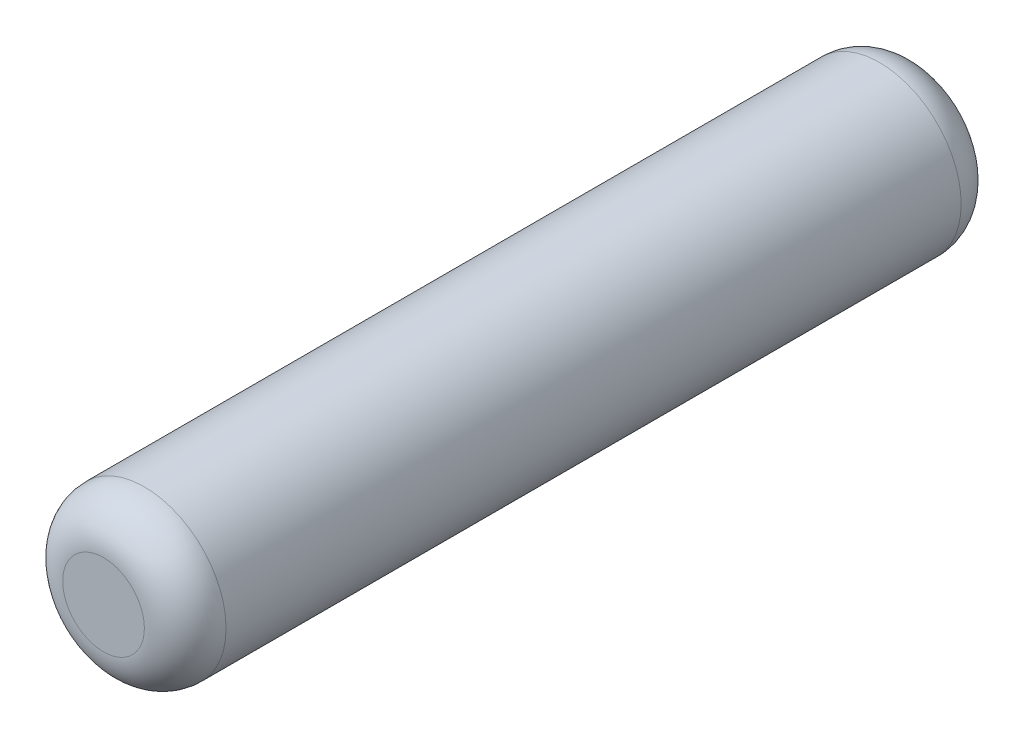
ISO-10303-21;
HEADER;
FILE_DESCRIPTION(('STEP AP214'),'2;1');
FILE_NAME('part.step','',(''),(''),'','','');
FILE_SCHEMA(('AUTOMOTIVE_DESIGN { 1 0 10303 214 1 1 1 1 }'));
ENDSEC;
DATA;
#1=APPLICATION_CONTEXT('core data for automotive mechanical design processes');
#2=APPLICATION_PROTOCOL_DEFINITION('international standard','automotive_design',2000,#1);
#3=PRODUCT_CONTEXT('',#1,'mechanical');
#4=PRODUCT('Part','Part','',(#3));
#5=PRODUCT_RELATED_PRODUCT_CATEGORY('part','',(#4));
#6=PRODUCT_DEFINITION_FORMATION('','',#4);
#7=PRODUCT_DEFINITION_CONTEXT('part definition',#1,'design');
#8=PRODUCT_DEFINITION('design','',#6,#7);
#9=PRODUCT_DEFINITION_SHAPE('','',#8);
#10=(LENGTH_UNIT() NAMED_UNIT(*) SI_UNIT(.MILLI.,.METRE.));
#11=(NAMED_UNIT(*) PLANE_ANGLE_UNIT() SI_UNIT($,.RADIAN.));
#12=(NAMED_UNIT(*) SI_UNIT($,.STERADIAN.) SOLID_ANGLE_UNIT());
#13=UNCERTAINTY_MEASURE_WITH_UNIT(LENGTH_MEASURE(1.E-05),#10,'distance_accuracy_value','');
#14=(GEOMETRIC_REPRESENTATION_CONTEXT(3) GLOBAL_UNCERTAINTY_ASSIGNED_CONTEXT((#13)) GLOBAL_UNIT_ASSIGNED_CONTEXT((#10,
#11,#12)) REPRESENTATION_CONTEXT('',''));
#15=CARTESIAN_POINT('',(0.,0.,0.));
#16=DIRECTION('',(0.,0.,1.));
#17=DIRECTION('',(1.,0.,0.));
#18=AXIS2_PLACEMENT_3D('',#15,#16,#17);
#19=CARTESIAN_POINT('',(0.,0.,10.));
#20=DIRECTION('',(0.,0.,-1.));
#21=DIRECTION('',(-1.,0.,0.));
#22=AXIS2_PLACEMENT_3D('',#19,#20,#21);
#23=CYLINDRICAL_SURFACE('',#22,2.);
#24=CARTESIAN_POINT('',(0.,0.,-9.));
#25=DIRECTION('',(0.,0.,1.));
#26=DIRECTION('',(1.,0.,0.));
#27=AXIS2_PLACEMENT_3D('',#24,#25,#26);
#28=CIRCLE('',#27,2.);
#29=CARTESIAN_POINT('',(2.,0.,-9.));
#30=VERTEX_POINT('',#29);
#31=EDGE_CURVE('E42',#30,#30,#28,.T.);
#32=ORIENTED_EDGE('',*,*,#31,.T.);
#33=EDGE_LOOP('',(#32));
#34=FACE_BOUND('',#33,.T.);
#35=CARTESIAN_POINT('',(0.,0.,9.));
#36=DIRECTION('',(0.,0.,1.));
#37=DIRECTION('',(1.,0.,0.));
#38=AXIS2_PLACEMENT_3D('',#35,#36,#37);
#39=CIRCLE('',#38,2.);
#40=CARTESIAN_POINT('',(2.,0.,9.));
#41=VERTEX_POINT('',#40);
#42=EDGE_CURVE('E46',#41,#41,#39,.F.);
#43=ORIENTED_EDGE('',*,*,#42,.T.);
#44=EDGE_LOOP('',(#43));
#45=FACE_BOUND('',#44,.T.);
#46=ADVANCED_FACE('F31',(#34,#45),#23,.T.);
#47=CARTESIAN_POINT('',(0.,0.,10.));
#48=DIRECTION('',(0.,0.,1.));
#49=DIRECTION('',(1.,0.,0.));
#50=AXIS2_PLACEMENT_3D('',#47,#48,#49);
#51=PLANE('',#50);
#52=CARTESIAN_POINT('',(0.,0.,10.));
#53=DIRECTION('',(0.,0.,1.));
#54=DIRECTION('',(1.,0.,0.));
#55=AXIS2_PLACEMENT_3D('',#52,#53,#54);
#56=CIRCLE('',#55,1.);
#57=CARTESIAN_POINT('',(1.,0.,10.));
#58=VERTEX_POINT('',#57);
#59=EDGE_CURVE('E10',#58,#58,#56,.T.);
#60=ORIENTED_EDGE('',*,*,#59,.T.);
#61=EDGE_LOOP('',(#60));
#62=FACE_BOUND('',#61,.T.);
#63=ADVANCED_FACE('F62',(#62),#51,.T.);
#64=CARTESIAN_POINT('',(0.,0.,-10.));
#65=DIRECTION('',(0.,0.,1.));
#66=DIRECTION('',(1.,0.,0.));
#67=AXIS2_PLACEMENT_3D('',#64,#65,#66);
#68=PLANE('',#67);
#69=CARTESIAN_POINT('',(0.,0.,-10.));
#70=DIRECTION('',(0.,0.,1.));
#71=DIRECTION('',(1.,0.,0.));
#72=AXIS2_PLACEMENT_3D('',#69,#70,#71);
#73=CIRCLE('',#72,1.);
#74=CARTESIAN_POINT('',(1.,0.,-10.));
#75=VERTEX_POINT('',#74);
#76=EDGE_CURVE('E38',#75,#75,#73,.F.);
#77=ORIENTED_EDGE('',*,*,#76,.T.);
#78=EDGE_LOOP('',(#77));
#79=FACE_BOUND('',#78,.T.);
#80=ADVANCED_FACE('F59',(#79),#68,.F.);
#81=CARTESIAN_POINT('',(0.,0.,-9.));
#82=DIRECTION('',(0.,0.,1.));
#83=DIRECTION('',(1.,0.,0.));
#84=AXIS2_PLACEMENT_3D('',#81,#82,#83);
#85=DEGENERATE_TOROIDAL_SURFACE('',#84,1.,1.,.T.);
#86=ORIENTED_EDGE('',*,*,#76,.F.);
#87=EDGE_LOOP('',(#86));
#88=FACE_BOUND('',#87,.T.);
#89=ORIENTED_EDGE('',*,*,#31,.F.);
#90=EDGE_LOOP('',(#89));
#91=FACE_BOUND('',#90,.T.);
#92=ADVANCED_FACE('F55',(#88,#91),#85,.T.);
#93=CARTESIAN_POINT('',(0.,0.,9.));
#94=DIRECTION('',(0.,0.,1.));
#95=DIRECTION('',(1.,0.,0.));
#96=AXIS2_PLACEMENT_3D('',#93,#94,#95);
#97=DEGENERATE_TOROIDAL_SURFACE('',#96,1.,1.,.T.);
#98=ORIENTED_EDGE('',*,*,#42,.F.);
#99=EDGE_LOOP('',(#98));
#100=FACE_BOUND('',#99,.T.);
#101=ORIENTED_EDGE('',*,*,#59,.F.);
#102=EDGE_LOOP('',(#101));
#103=FACE_BOUND('',#102,.T.);
#104=ADVANCED_FACE('F33',(#100,#103),#97,.T.);
#105=CLOSED_SHELL('',(#46,#63,#80,#92,#104));
#106=MANIFOLD_SOLID_BREP('B2',#105);
#107=ADVANCED_BREP_SHAPE_REPRESENTATION('',(#18,#106),#14);
#108=SHAPE_DEFINITION_REPRESENTATION(#9,#107);
ENDSEC;
END-ISO-10303-21;
